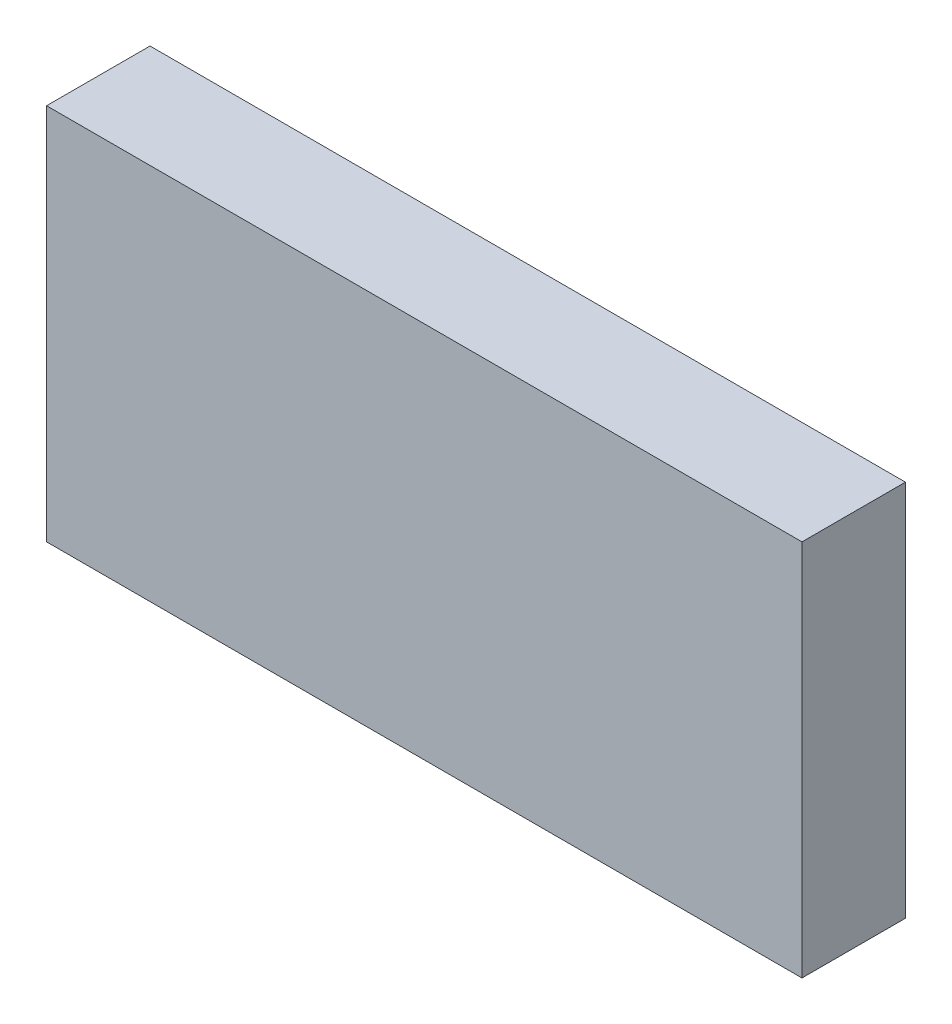
ISO-10303-21;
HEADER;
FILE_DESCRIPTION(('STEP AP214'),'2;1');
FILE_NAME('part.step','',(''),(''),'','','');
FILE_SCHEMA(('AUTOMOTIVE_DESIGN { 1 0 10303 214 1 1 1 1 }'));
ENDSEC;
DATA;
#1=APPLICATION_CONTEXT('core data for automotive mechanical design processes');
#2=APPLICATION_PROTOCOL_DEFINITION('international standard','automotive_design',2000,#1);
#3=PRODUCT_CONTEXT('',#1,'mechanical');
#4=PRODUCT('Part','Part','',(#3));
#5=PRODUCT_RELATED_PRODUCT_CATEGORY('part','',(#4));
#6=PRODUCT_DEFINITION_FORMATION('','',#4);
#7=PRODUCT_DEFINITION_CONTEXT('part definition',#1,'design');
#8=PRODUCT_DEFINITION('design','',#6,#7);
#9=PRODUCT_DEFINITION_SHAPE('','',#8);
#10=(LENGTH_UNIT() NAMED_UNIT(*) SI_UNIT(.MILLI.,.METRE.));
#11=(NAMED_UNIT(*) PLANE_ANGLE_UNIT() SI_UNIT($,.RADIAN.));
#12=(NAMED_UNIT(*) SI_UNIT($,.STERADIAN.) SOLID_ANGLE_UNIT());
#13=UNCERTAINTY_MEASURE_WITH_UNIT(LENGTH_MEASURE(1.E-05),#10,'distance_accuracy_value','');
#14=(GEOMETRIC_REPRESENTATION_CONTEXT(3) GLOBAL_UNCERTAINTY_ASSIGNED_CONTEXT((#13)) GLOBAL_UNIT_ASSIGNED_CONTEXT((#10,
#11,#12)) REPRESENTATION_CONTEXT('',''));
#15=CARTESIAN_POINT('',(0.,0.,0.));
#16=DIRECTION('',(0.,0.,1.));
#17=DIRECTION('',(1.,0.,0.));
#18=AXIS2_PLACEMENT_3D('',#15,#16,#17);
#19=CARTESIAN_POINT('',(-0.5842,-0.2921,0.15999968));
#20=DIRECTION('',(0.,0.,-1.));
#21=DIRECTION('',(0.,-1.,0.));
#22=AXIS2_PLACEMENT_3D('',#19,#20,#21);
#23=PLANE('',#22);
#24=DIRECTION('',(1.,0.,0.));
#25=VECTOR('',#24,1.);
#26=CARTESIAN_POINT('',(-0.5842,-0.2921,0.15999968));
#27=LINE('',#26,#25);
#28=CARTESIAN_POINT('',(-0.5842,-0.2921,0.15999968));
#29=VERTEX_POINT('',#28);
#30=CARTESIAN_POINT('',(0.5842,-0.2921,0.15999968));
#31=VERTEX_POINT('',#30);
#32=EDGE_CURVE('E83',#29,#31,#27,.T.);
#33=ORIENTED_EDGE('',*,*,#32,.T.);
#34=DIRECTION('',(0.,1.,0.));
#35=VECTOR('',#34,1.);
#36=CARTESIAN_POINT('',(0.5842,-0.2921,0.15999968));
#37=LINE('',#36,#35);
#38=CARTESIAN_POINT('',(0.5842,0.2921,0.15999968));
#39=VERTEX_POINT('',#38);
#40=EDGE_CURVE('E81',#31,#39,#37,.T.);
#41=ORIENTED_EDGE('',*,*,#40,.T.);
#42=DIRECTION('',(-1.,0.,0.));
#43=VECTOR('',#42,1.);
#44=CARTESIAN_POINT('',(0.5842,0.2921,0.15999968));
#45=LINE('',#44,#43);
#46=CARTESIAN_POINT('',(-0.5842,0.2921,0.15999968));
#47=VERTEX_POINT('',#46);
#48=EDGE_CURVE('E71',#39,#47,#45,.T.);
#49=ORIENTED_EDGE('',*,*,#48,.T.);
#50=DIRECTION('',(0.,-1.,0.));
#51=VECTOR('',#50,1.);
#52=CARTESIAN_POINT('',(-0.5842,0.2921,0.15999968));
#53=LINE('',#52,#51);
#54=EDGE_CURVE('E11',#47,#29,#53,.T.);
#55=ORIENTED_EDGE('',*,*,#54,.T.);
#56=EDGE_LOOP('',(#33,#41,#49,#55));
#57=FACE_BOUND('',#56,.T.);
#58=ADVANCED_FACE('F17',(#57),#23,.F.);
#59=CARTESIAN_POINT('',(-0.5842,-0.2921,0.));
#60=DIRECTION('',(0.,0.,-1.));
#61=DIRECTION('',(0.,-1.,0.));
#62=AXIS2_PLACEMENT_3D('',#59,#60,#61);
#63=PLANE('',#62);
#64=DIRECTION('',(1.,0.,0.));
#65=VECTOR('',#64,1.);
#66=CARTESIAN_POINT('',(-0.5842,-0.2921,0.));
#67=LINE('',#66,#65);
#68=CARTESIAN_POINT('',(-0.5842,-0.2921,0.));
#69=VERTEX_POINT('',#68);
#70=CARTESIAN_POINT('',(0.5842,-0.2921,0.));
#71=VERTEX_POINT('',#70);
#72=EDGE_CURVE('E103',#69,#71,#67,.T.);
#73=ORIENTED_EDGE('',*,*,#72,.F.);
#74=DIRECTION('',(0.,-1.,0.));
#75=VECTOR('',#74,1.);
#76=CARTESIAN_POINT('',(-0.5842,0.2921,0.));
#77=LINE('',#76,#75);
#78=CARTESIAN_POINT('',(-0.5842,0.2921,0.));
#79=VERTEX_POINT('',#78);
#80=EDGE_CURVE('E28',#79,#69,#77,.T.);
#81=ORIENTED_EDGE('',*,*,#80,.F.);
#82=DIRECTION('',(-1.,0.,0.));
#83=VECTOR('',#82,1.);
#84=CARTESIAN_POINT('',(0.5842,0.2921,0.));
#85=LINE('',#84,#83);
#86=CARTESIAN_POINT('',(0.5842,0.2921,0.));
#87=VERTEX_POINT('',#86);
#88=EDGE_CURVE('E63',#87,#79,#85,.T.);
#89=ORIENTED_EDGE('',*,*,#88,.F.);
#90=DIRECTION('',(0.,1.,0.));
#91=VECTOR('',#90,1.);
#92=CARTESIAN_POINT('',(0.5842,-0.2921,0.));
#93=LINE('',#92,#91);
#94=EDGE_CURVE('E89',#71,#87,#93,.T.);
#95=ORIENTED_EDGE('',*,*,#94,.F.);
#96=EDGE_LOOP('',(#73,#81,#89,#95));
#97=FACE_BOUND('',#96,.T.);
#98=ADVANCED_FACE('F144',(#97),#63,.T.);
#99=CARTESIAN_POINT('',(-0.5842,0.2921,0.));
#100=DIRECTION('',(1.,0.,0.));
#101=DIRECTION('',(0.,1.,0.));
#102=AXIS2_PLACEMENT_3D('',#99,#100,#101);
#103=PLANE('',#102);
#104=DIRECTION('',(0.,0.,1.));
#105=VECTOR('',#104,1.);
#106=CARTESIAN_POINT('',(-0.5842,0.2921,0.));
#107=LINE('',#106,#105);
#108=EDGE_CURVE('E76',#79,#47,#107,.T.);
#109=ORIENTED_EDGE('',*,*,#108,.F.);
#110=ORIENTED_EDGE('',*,*,#80,.T.);
#111=DIRECTION('',(0.,0.,1.));
#112=VECTOR('',#111,1.);
#113=CARTESIAN_POINT('',(-0.5842,-0.2921,0.));
#114=LINE('',#113,#112);
#115=EDGE_CURVE('E21',#69,#29,#114,.T.);
#116=ORIENTED_EDGE('',*,*,#115,.T.);
#117=ORIENTED_EDGE('',*,*,#54,.F.);
#118=EDGE_LOOP('',(#109,#110,#116,#117));
#119=FACE_BOUND('',#118,.T.);
#120=ADVANCED_FACE('F165',(#119),#103,.F.);
#121=CARTESIAN_POINT('',(0.5842,0.2921,0.));
#122=DIRECTION('',(0.,-1.,0.));
#123=DIRECTION('',(0.,0.,-1.));
#124=AXIS2_PLACEMENT_3D('',#121,#122,#123);
#125=PLANE('',#124);
#126=DIRECTION('',(0.,0.,1.));
#127=VECTOR('',#126,1.);
#128=CARTESIAN_POINT('',(0.5842,0.2921,0.));
#129=LINE('',#128,#127);
#130=EDGE_CURVE('E74',#87,#39,#129,.T.);
#131=ORIENTED_EDGE('',*,*,#130,.F.);
#132=ORIENTED_EDGE('',*,*,#88,.T.);
#133=ORIENTED_EDGE('',*,*,#108,.T.);
#134=ORIENTED_EDGE('',*,*,#48,.F.);
#135=EDGE_LOOP('',(#131,#132,#133,#134));
#136=FACE_BOUND('',#135,.T.);
#137=ADVANCED_FACE('F19',(#136),#125,.F.);
#138=CARTESIAN_POINT('',(0.5842,-0.2921,0.));
#139=DIRECTION('',(-1.,0.,0.));
#140=DIRECTION('',(0.,0.,1.));
#141=AXIS2_PLACEMENT_3D('',#138,#139,#140);
#142=PLANE('',#141);
#143=DIRECTION('',(0.,0.,1.));
#144=VECTOR('',#143,1.);
#145=CARTESIAN_POINT('',(0.5842,-0.2921,0.));
#146=LINE('',#145,#144);
#147=EDGE_CURVE('E101',#71,#31,#146,.T.);
#148=ORIENTED_EDGE('',*,*,#147,.F.);
#149=ORIENTED_EDGE('',*,*,#94,.T.);
#150=ORIENTED_EDGE('',*,*,#130,.T.);
#151=ORIENTED_EDGE('',*,*,#40,.F.);
#152=EDGE_LOOP('',(#148,#149,#150,#151));
#153=FACE_BOUND('',#152,.T.);
#154=ADVANCED_FACE('F88',(#153),#142,.F.);
#155=CARTESIAN_POINT('',(-0.5842,-0.2921,0.));
#156=DIRECTION('',(0.,1.,0.));
#157=DIRECTION('',(1.,0.,0.));
#158=AXIS2_PLACEMENT_3D('',#155,#156,#157);
#159=PLANE('',#158);
#160=ORIENTED_EDGE('',*,*,#115,.F.);
#161=ORIENTED_EDGE('',*,*,#72,.T.);
#162=ORIENTED_EDGE('',*,*,#147,.T.);
#163=ORIENTED_EDGE('',*,*,#32,.F.);
#164=EDGE_LOOP('',(#160,#161,#162,#163));
#165=FACE_BOUND('',#164,.T.);
#166=ADVANCED_FACE('F153',(#165),#159,.F.);
#167=CLOSED_SHELL('',(#58,#98,#120,#137,#154,#166));
#168=MANIFOLD_SOLID_BREP('B1',#167);
#169=ADVANCED_BREP_SHAPE_REPRESENTATION('',(#18,#168),#14);
#170=SHAPE_DEFINITION_REPRESENTATION(#9,#169);
ENDSEC;
END-ISO-10303-21;
